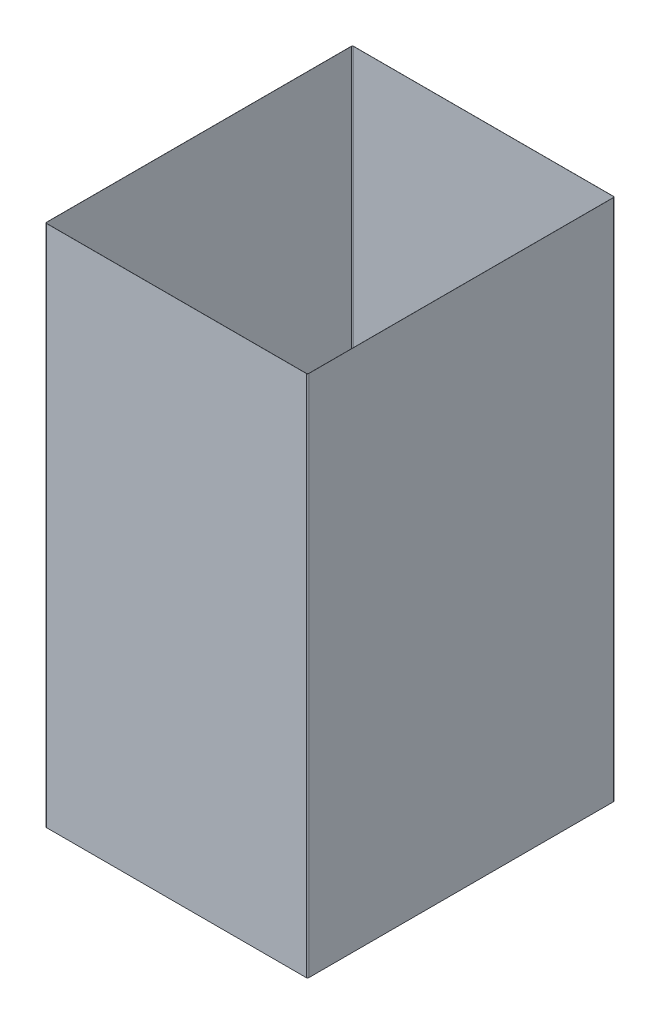
ISO-10303-21;
HEADER;
FILE_DESCRIPTION(('STEP AP214'),'2;1');
FILE_NAME('part.step','',(''),(''),'','','');
FILE_SCHEMA(('AUTOMOTIVE_DESIGN { 1 0 10303 214 1 1 1 1 }'));
ENDSEC;
DATA;
#1=APPLICATION_CONTEXT('core data for automotive mechanical design processes');
#2=APPLICATION_PROTOCOL_DEFINITION('international standard','automotive_design',2000,#1);
#3=PRODUCT_CONTEXT('',#1,'mechanical');
#4=PRODUCT('Part','Part','',(#3));
#5=PRODUCT_RELATED_PRODUCT_CATEGORY('part','',(#4));
#6=PRODUCT_DEFINITION_FORMATION('','',#4);
#7=PRODUCT_DEFINITION_CONTEXT('part definition',#1,'design');
#8=PRODUCT_DEFINITION('design','',#6,#7);
#9=PRODUCT_DEFINITION_SHAPE('','',#8);
#10=(LENGTH_UNIT() NAMED_UNIT(*) SI_UNIT(.MILLI.,.METRE.));
#11=(NAMED_UNIT(*) PLANE_ANGLE_UNIT() SI_UNIT($,.RADIAN.));
#12=(NAMED_UNIT(*) SI_UNIT($,.STERADIAN.) SOLID_ANGLE_UNIT());
#13=UNCERTAINTY_MEASURE_WITH_UNIT(LENGTH_MEASURE(1.E-05),#10,'distance_accuracy_value','');
#14=(GEOMETRIC_REPRESENTATION_CONTEXT(3) GLOBAL_UNCERTAINTY_ASSIGNED_CONTEXT((#13)) GLOBAL_UNIT_ASSIGNED_CONTEXT((#10,
#11,#12)) REPRESENTATION_CONTEXT('',''));
#15=CARTESIAN_POINT('',(0.,0.,0.));
#16=DIRECTION('',(0.,0.,1.));
#17=DIRECTION('',(1.,0.,0.));
#18=AXIS2_PLACEMENT_3D('',#15,#16,#17);
#19=CARTESIAN_POINT('',(241.7,484.8,-283.25));
#20=DIRECTION('',(0.,-1.,0.));
#21=DIRECTION('',(0.,0.,-1.));
#22=AXIS2_PLACEMENT_3D('',#19,#20,#21);
#23=PLANE('',#22);
#24=CARTESIAN_POINT('',(241.7,484.8,-283.25));
#25=DIRECTION('',(0.,-1.,0.));
#26=DIRECTION('',(-1.,0.,0.));
#27=AXIS2_PLACEMENT_3D('',#24,#25,#26);
#28=CIRCLE('',#27,1.1);
#29=CARTESIAN_POINT('',(242.8,484.8,-283.25));
#30=VERTEX_POINT('',#29);
#31=CARTESIAN_POINT('',(241.7,484.8,-284.35));
#32=VERTEX_POINT('',#31);
#33=EDGE_CURVE('E261',#30,#32,#28,.F.);
#34=ORIENTED_EDGE('',*,*,#33,.T.);
#35=DIRECTION('',(-1.,0.,0.));
#36=VECTOR('',#35,1.);
#37=CARTESIAN_POINT('',(241.7,484.8,-284.35));
#38=LINE('',#37,#36);
#39=CARTESIAN_POINT('',(1.00000000000001,484.8,-284.35));
#40=VERTEX_POINT('',#39);
#41=EDGE_CURVE('E264',#32,#40,#38,.T.);
#42=ORIENTED_EDGE('',*,*,#41,.T.);
#43=CARTESIAN_POINT('',(1.,484.8,-283.25));
#44=DIRECTION('',(0.,-1.,0.));
#45=DIRECTION('',(-1.,0.,0.));
#46=AXIS2_PLACEMENT_3D('',#43,#44,#45);
#47=CIRCLE('',#46,1.1);
#48=CARTESIAN_POINT('',(-0.100000000000001,484.8,-283.25));
#49=VERTEX_POINT('',#48);
#50=EDGE_CURVE('E267',#40,#49,#47,.F.);
#51=ORIENTED_EDGE('',*,*,#50,.T.);
#52=DIRECTION('',(0.,0.,1.));
#53=VECTOR('',#52,1.);
#54=CARTESIAN_POINT('',(-0.099999999999989,484.8,-283.25));
#55=LINE('',#54,#53);
#56=CARTESIAN_POINT('',(-0.1,484.8,-1.00000000000001));
#57=VERTEX_POINT('',#56);
#58=EDGE_CURVE('E269',#49,#57,#55,.T.);
#59=ORIENTED_EDGE('',*,*,#58,.T.);
#60=CARTESIAN_POINT('',(1.,484.8,-1.));
#61=DIRECTION('',(0.,-1.,0.));
#62=DIRECTION('',(-1.,0.,0.));
#63=AXIS2_PLACEMENT_3D('',#60,#61,#62);
#64=CIRCLE('',#63,1.1);
#65=CARTESIAN_POINT('',(1.00000000000001,484.8,0.1));
#66=VERTEX_POINT('',#65);
#67=EDGE_CURVE('E271',#57,#66,#64,.F.);
#68=ORIENTED_EDGE('',*,*,#67,.T.);
#69=DIRECTION('',(1.,0.,0.));
#70=VECTOR('',#69,1.);
#71=CARTESIAN_POINT('',(241.7,484.8,0.099999999999989));
#72=LINE('',#71,#70);
#73=CARTESIAN_POINT('',(241.7,484.8,0.1));
#74=VERTEX_POINT('',#73);
#75=EDGE_CURVE('E273',#66,#74,#72,.T.);
#76=ORIENTED_EDGE('',*,*,#75,.T.);
#77=CARTESIAN_POINT('',(241.7,484.8,-1.));
#78=DIRECTION('',(0.,-1.,0.));
#79=DIRECTION('',(-1.,0.,0.));
#80=AXIS2_PLACEMENT_3D('',#77,#78,#79);
#81=CIRCLE('',#80,1.1);
#82=CARTESIAN_POINT('',(242.8,484.8,-1.00000000000001));
#83=VERTEX_POINT('',#82);
#84=EDGE_CURVE('E275',#74,#83,#81,.F.);
#85=ORIENTED_EDGE('',*,*,#84,.T.);
#86=DIRECTION('',(0.,0.,-1.));
#87=VECTOR('',#86,1.);
#88=CARTESIAN_POINT('',(242.8,484.8,-283.25));
#89=LINE('',#88,#87);
#90=EDGE_CURVE('E277',#83,#30,#89,.T.);
#91=ORIENTED_EDGE('',*,*,#90,.T.);
#92=EDGE_LOOP('',(#34,#42,#51,#59,#68,#76,#85,#91));
#93=FACE_BOUND('',#92,.T.);
#94=CARTESIAN_POINT('',(241.7,484.8,-283.25));
#95=DIRECTION('',(0.,1.,0.));
#96=DIRECTION('',(0.,0.,-1.));
#97=AXIS2_PLACEMENT_3D('',#94,#95,#96);
#98=CIRCLE('',#97,1.);
#99=CARTESIAN_POINT('',(242.7,484.8,-283.25));
#100=VERTEX_POINT('',#99);
#101=CARTESIAN_POINT('',(241.7,484.8,-284.25));
#102=VERTEX_POINT('',#101);
#103=EDGE_CURVE('E196',#100,#102,#98,.T.);
#104=ORIENTED_EDGE('',*,*,#103,.F.);
#105=DIRECTION('',(0.,0.,-1.));
#106=VECTOR('',#105,1.);
#107=CARTESIAN_POINT('',(242.7,484.8,-1.00000000000001));
#108=LINE('',#107,#106);
#109=CARTESIAN_POINT('',(242.7,484.8,-1.));
#110=VERTEX_POINT('',#109);
#111=EDGE_CURVE('E229',#110,#100,#108,.T.);
#112=ORIENTED_EDGE('',*,*,#111,.F.);
#113=CARTESIAN_POINT('',(241.7,484.8,-1.));
#114=DIRECTION('',(0.,1.,0.));
#115=DIRECTION('',(0.,0.,1.));
#116=AXIS2_PLACEMENT_3D('',#113,#114,#115);
#117=CIRCLE('',#116,1.);
#118=CARTESIAN_POINT('',(241.7,484.8,0.));
#119=VERTEX_POINT('',#118);
#120=EDGE_CURVE('E227',#119,#110,#117,.T.);
#121=ORIENTED_EDGE('',*,*,#120,.F.);
#122=DIRECTION('',(1.,0.,0.));
#123=VECTOR('',#122,1.);
#124=CARTESIAN_POINT('',(1.00000000000001,484.8,0.));
#125=LINE('',#124,#123);
#126=CARTESIAN_POINT('',(1.00000000000001,484.8,0.));
#127=VERTEX_POINT('',#126);
#128=EDGE_CURVE('E225',#127,#119,#125,.T.);
#129=ORIENTED_EDGE('',*,*,#128,.F.);
#130=CARTESIAN_POINT('',(1.,484.8,-1.));
#131=DIRECTION('',(0.,1.,0.));
#132=DIRECTION('',(0.,0.,-1.));
#133=AXIS2_PLACEMENT_3D('',#130,#131,#132);
#134=CIRCLE('',#133,1.);
#135=CARTESIAN_POINT('',(0.,484.8,-1.00000000000001));
#136=VERTEX_POINT('',#135);
#137=EDGE_CURVE('E223',#136,#127,#134,.T.);
#138=ORIENTED_EDGE('',*,*,#137,.F.);
#139=DIRECTION('',(0.,0.,1.));
#140=VECTOR('',#139,1.);
#141=CARTESIAN_POINT('',(0.,484.8,-1.00000000000001));
#142=LINE('',#141,#140);
#143=CARTESIAN_POINT('',(0.,484.8,-283.25));
#144=VERTEX_POINT('',#143);
#145=EDGE_CURVE('E219',#144,#136,#142,.T.);
#146=ORIENTED_EDGE('',*,*,#145,.F.);
#147=CARTESIAN_POINT('',(1.,484.8,-283.25));
#148=DIRECTION('',(0.,1.,0.));
#149=DIRECTION('',(0.,0.,-1.));
#150=AXIS2_PLACEMENT_3D('',#147,#148,#149);
#151=CIRCLE('',#150,1.);
#152=CARTESIAN_POINT('',(1.00000000000001,484.8,-284.25));
#153=VERTEX_POINT('',#152);
#154=EDGE_CURVE('E217',#153,#144,#151,.T.);
#155=ORIENTED_EDGE('',*,*,#154,.F.);
#156=DIRECTION('',(-1.,0.,0.));
#157=VECTOR('',#156,1.);
#158=CARTESIAN_POINT('',(1.00000000000001,484.8,-284.25));
#159=LINE('',#158,#157);
#160=EDGE_CURVE('E204',#102,#153,#159,.T.);
#161=ORIENTED_EDGE('',*,*,#160,.F.);
#162=EDGE_LOOP('',(#104,#112,#121,#129,#138,#146,#155,#161));
#163=FACE_BOUND('',#162,.T.);
#164=ADVANCED_FACE('F83',(#93,#163),#23,.F.);
#165=CARTESIAN_POINT('',(241.7,0.,-283.25));
#166=DIRECTION('',(0.,-1.,0.));
#167=DIRECTION('',(0.,0.,-1.));
#168=AXIS2_PLACEMENT_3D('',#165,#166,#167);
#169=PLANE('',#168);
#170=CARTESIAN_POINT('',(241.7,0.,-283.25));
#171=DIRECTION('',(0.,-1.,0.));
#172=DIRECTION('',(-1.,0.,0.));
#173=AXIS2_PLACEMENT_3D('',#170,#171,#172);
#174=CIRCLE('',#173,1.1);
#175=CARTESIAN_POINT('',(242.8,0.,-283.25));
#176=VERTEX_POINT('',#175);
#177=CARTESIAN_POINT('',(241.7,0.,-284.35));
#178=VERTEX_POINT('',#177);
#179=EDGE_CURVE('E212',#176,#178,#174,.F.);
#180=ORIENTED_EDGE('',*,*,#179,.F.);
#181=DIRECTION('',(0.,0.,-1.));
#182=VECTOR('',#181,1.);
#183=CARTESIAN_POINT('',(242.8,0.,-283.25));
#184=LINE('',#183,#182);
#185=CARTESIAN_POINT('',(242.8,0.,-1.00000000000001));
#186=VERTEX_POINT('',#185);
#187=EDGE_CURVE('E265',#186,#176,#184,.T.);
#188=ORIENTED_EDGE('',*,*,#187,.F.);
#189=CARTESIAN_POINT('',(241.7,0.,-1.));
#190=DIRECTION('',(0.,-1.,0.));
#191=DIRECTION('',(-1.,0.,0.));
#192=AXIS2_PLACEMENT_3D('',#189,#190,#191);
#193=CIRCLE('',#192,1.1);
#194=CARTESIAN_POINT('',(241.7,0.,0.1));
#195=VERTEX_POINT('',#194);
#196=EDGE_CURVE('E292',#195,#186,#193,.F.);
#197=ORIENTED_EDGE('',*,*,#196,.F.);
#198=DIRECTION('',(1.,0.,0.));
#199=VECTOR('',#198,1.);
#200=CARTESIAN_POINT('',(241.7,0.,0.099999999999989));
#201=LINE('',#200,#199);
#202=CARTESIAN_POINT('',(1.00000000000001,0.,0.1));
#203=VERTEX_POINT('',#202);
#204=EDGE_CURVE('E290',#203,#195,#201,.T.);
#205=ORIENTED_EDGE('',*,*,#204,.F.);
#206=CARTESIAN_POINT('',(1.,0.,-1.));
#207=DIRECTION('',(0.,-1.,0.));
#208=DIRECTION('',(-1.,0.,0.));
#209=AXIS2_PLACEMENT_3D('',#206,#207,#208);
#210=CIRCLE('',#209,1.1);
#211=CARTESIAN_POINT('',(-0.1,0.,-1.00000000000001));
#212=VERTEX_POINT('',#211);
#213=EDGE_CURVE('E288',#212,#203,#210,.F.);
#214=ORIENTED_EDGE('',*,*,#213,.F.);
#215=DIRECTION('',(0.,0.,1.));
#216=VECTOR('',#215,1.);
#217=CARTESIAN_POINT('',(-0.099999999999989,0.,-283.25));
#218=LINE('',#217,#216);
#219=CARTESIAN_POINT('',(-0.100000000000001,0.,-283.25));
#220=VERTEX_POINT('',#219);
#221=EDGE_CURVE('E286',#220,#212,#218,.T.);
#222=ORIENTED_EDGE('',*,*,#221,.F.);
#223=CARTESIAN_POINT('',(1.,0.,-283.25));
#224=DIRECTION('',(0.,-1.,0.));
#225=DIRECTION('',(-1.,0.,0.));
#226=AXIS2_PLACEMENT_3D('',#223,#224,#225);
#227=CIRCLE('',#226,1.1);
#228=CARTESIAN_POINT('',(1.00000000000001,0.,-284.35));
#229=VERTEX_POINT('',#228);
#230=EDGE_CURVE('E284',#229,#220,#227,.F.);
#231=ORIENTED_EDGE('',*,*,#230,.F.);
#232=DIRECTION('',(-1.,0.,0.));
#233=VECTOR('',#232,1.);
#234=CARTESIAN_POINT('',(241.7,0.,-284.35));
#235=LINE('',#234,#233);
#236=EDGE_CURVE('E282',#178,#229,#235,.T.);
#237=ORIENTED_EDGE('',*,*,#236,.F.);
#238=EDGE_LOOP('',(#180,#188,#197,#205,#214,#222,#231,#237));
#239=FACE_BOUND('',#238,.T.);
#240=DIRECTION('',(0.,0.,-1.));
#241=VECTOR('',#240,1.);
#242=CARTESIAN_POINT('',(242.7,0.,-1.00000000000001));
#243=LINE('',#242,#241);
#244=CARTESIAN_POINT('',(242.7,0.,-1.00000000000001));
#245=VERTEX_POINT('',#244);
#246=CARTESIAN_POINT('',(242.7,0.,-283.25));
#247=VERTEX_POINT('',#246);
#248=EDGE_CURVE('E205',#245,#247,#243,.T.);
#249=ORIENTED_EDGE('',*,*,#248,.T.);
#250=CARTESIAN_POINT('',(241.7,0.,-283.25));
#251=DIRECTION('',(0.,1.,0.));
#252=DIRECTION('',(0.,0.,-1.));
#253=AXIS2_PLACEMENT_3D('',#250,#251,#252);
#254=CIRCLE('',#253,1.);
#255=CARTESIAN_POINT('',(241.7,0.,-284.25));
#256=VERTEX_POINT('',#255);
#257=EDGE_CURVE('E106',#247,#256,#254,.T.);
#258=ORIENTED_EDGE('',*,*,#257,.T.);
#259=DIRECTION('',(-1.,0.,0.));
#260=VECTOR('',#259,1.);
#261=CARTESIAN_POINT('',(1.00000000000001,0.,-284.25));
#262=LINE('',#261,#260);
#263=CARTESIAN_POINT('',(1.00000000000001,0.,-284.25));
#264=VERTEX_POINT('',#263);
#265=EDGE_CURVE('E211',#256,#264,#262,.T.);
#266=ORIENTED_EDGE('',*,*,#265,.T.);
#267=CARTESIAN_POINT('',(1.,0.,-283.25));
#268=DIRECTION('',(0.,1.,0.));
#269=DIRECTION('',(0.,0.,-1.));
#270=AXIS2_PLACEMENT_3D('',#267,#268,#269);
#271=CIRCLE('',#270,1.);
#272=CARTESIAN_POINT('',(0.,0.,-283.25));
#273=VERTEX_POINT('',#272);
#274=EDGE_CURVE('E233',#264,#273,#271,.T.);
#275=ORIENTED_EDGE('',*,*,#274,.T.);
#276=DIRECTION('',(0.,0.,1.));
#277=VECTOR('',#276,1.);
#278=CARTESIAN_POINT('',(0.,0.,-1.00000000000001));
#279=LINE('',#278,#277);
#280=CARTESIAN_POINT('',(0.,0.,-1.00000000000001));
#281=VERTEX_POINT('',#280);
#282=EDGE_CURVE('E236',#273,#281,#279,.T.);
#283=ORIENTED_EDGE('',*,*,#282,.T.);
#284=CARTESIAN_POINT('',(1.,0.,-1.));
#285=DIRECTION('',(0.,1.,0.));
#286=DIRECTION('',(0.,0.,-1.));
#287=AXIS2_PLACEMENT_3D('',#284,#285,#286);
#288=CIRCLE('',#287,1.);
#289=CARTESIAN_POINT('',(1.00000000000001,0.,0.));
#290=VERTEX_POINT('',#289);
#291=EDGE_CURVE('E239',#281,#290,#288,.T.);
#292=ORIENTED_EDGE('',*,*,#291,.T.);
#293=DIRECTION('',(1.,0.,0.));
#294=VECTOR('',#293,1.);
#295=CARTESIAN_POINT('',(1.00000000000001,0.,0.));
#296=LINE('',#295,#294);
#297=CARTESIAN_POINT('',(241.7,0.,0.));
#298=VERTEX_POINT('',#297);
#299=EDGE_CURVE('E242',#290,#298,#296,.T.);
#300=ORIENTED_EDGE('',*,*,#299,.T.);
#301=CARTESIAN_POINT('',(241.7,0.,-1.));
#302=DIRECTION('',(0.,1.,0.));
#303=DIRECTION('',(0.,0.,1.));
#304=AXIS2_PLACEMENT_3D('',#301,#302,#303);
#305=CIRCLE('',#304,1.);
#306=EDGE_CURVE('E245',#298,#245,#305,.T.);
#307=ORIENTED_EDGE('',*,*,#306,.T.);
#308=EDGE_LOOP('',(#249,#258,#266,#275,#283,#292,#300,#307));
#309=FACE_BOUND('',#308,.T.);
#310=ADVANCED_FACE('F322',(#239,#309),#169,.T.);
#311=CARTESIAN_POINT('',(241.7,484.8,-283.25));
#312=DIRECTION('',(0.,-1.,0.));
#313=DIRECTION('',(0.,0.,-1.));
#314=AXIS2_PLACEMENT_3D('',#311,#312,#313);
#315=CYLINDRICAL_SURFACE('',#314,1.1);
#316=ORIENTED_EDGE('',*,*,#179,.T.);
#317=DIRECTION('',(0.,-1.,0.));
#318=VECTOR('',#317,1.);
#319=CARTESIAN_POINT('',(241.7,484.8,-284.35));
#320=LINE('',#319,#318);
#321=EDGE_CURVE('E12',#32,#178,#320,.T.);
#322=ORIENTED_EDGE('',*,*,#321,.F.);
#323=ORIENTED_EDGE('',*,*,#33,.F.);
#324=DIRECTION('',(0.,-1.,0.));
#325=VECTOR('',#324,1.);
#326=CARTESIAN_POINT('',(242.8,484.8,-283.25));
#327=LINE('',#326,#325);
#328=EDGE_CURVE('E279',#30,#176,#327,.T.);
#329=ORIENTED_EDGE('',*,*,#328,.T.);
#330=EDGE_LOOP('',(#316,#322,#323,#329));
#331=FACE_BOUND('',#330,.T.);
#332=ADVANCED_FACE('F85',(#331),#315,.T.);
#333=CARTESIAN_POINT('',(241.7,484.8,-284.35));
#334=DIRECTION('',(0.,0.,1.));
#335=DIRECTION('',(1.,0.,0.));
#336=AXIS2_PLACEMENT_3D('',#333,#334,#335);
#337=PLANE('',#336);
#338=ORIENTED_EDGE('',*,*,#236,.T.);
#339=DIRECTION('',(0.,-1.,0.));
#340=VECTOR('',#339,1.);
#341=CARTESIAN_POINT('',(1.00000000000001,484.8,-284.35));
#342=LINE('',#341,#340);
#343=EDGE_CURVE('E91',#40,#229,#342,.T.);
#344=ORIENTED_EDGE('',*,*,#343,.F.);
#345=ORIENTED_EDGE('',*,*,#41,.F.);
#346=ORIENTED_EDGE('',*,*,#321,.T.);
#347=EDGE_LOOP('',(#338,#344,#345,#346));
#348=FACE_BOUND('',#347,.T.);
#349=ADVANCED_FACE('F339',(#348),#337,.F.);
#350=CARTESIAN_POINT('',(1.,484.8,-283.25));
#351=DIRECTION('',(0.,-1.,0.));
#352=DIRECTION('',(0.,0.,-1.));
#353=AXIS2_PLACEMENT_3D('',#350,#351,#352);
#354=CYLINDRICAL_SURFACE('',#353,1.1);
#355=ORIENTED_EDGE('',*,*,#230,.T.);
#356=DIRECTION('',(0.,-1.,0.));
#357=VECTOR('',#356,1.);
#358=CARTESIAN_POINT('',(-0.100000000000001,484.8,-283.25));
#359=LINE('',#358,#357);
#360=EDGE_CURVE('E309',#49,#220,#359,.T.);
#361=ORIENTED_EDGE('',*,*,#360,.F.);
#362=ORIENTED_EDGE('',*,*,#50,.F.);
#363=ORIENTED_EDGE('',*,*,#343,.T.);
#364=EDGE_LOOP('',(#355,#361,#362,#363));
#365=FACE_BOUND('',#364,.T.);
#366=ADVANCED_FACE('F316',(#365),#354,.T.);
#367=CARTESIAN_POINT('',(-0.099999999999989,484.8,-283.25));
#368=DIRECTION('',(1.,0.,0.));
#369=DIRECTION('',(0.,0.,-1.));
#370=AXIS2_PLACEMENT_3D('',#367,#368,#369);
#371=PLANE('',#370);
#372=ORIENTED_EDGE('',*,*,#221,.T.);
#373=DIRECTION('',(0.,-1.,0.));
#374=VECTOR('',#373,1.);
#375=CARTESIAN_POINT('',(-0.1,484.8,-1.00000000000001));
#376=LINE('',#375,#374);
#377=EDGE_CURVE('E306',#57,#212,#376,.T.);
#378=ORIENTED_EDGE('',*,*,#377,.F.);
#379=ORIENTED_EDGE('',*,*,#58,.F.);
#380=ORIENTED_EDGE('',*,*,#360,.T.);
#381=EDGE_LOOP('',(#372,#378,#379,#380));
#382=FACE_BOUND('',#381,.T.);
#383=ADVANCED_FACE('F328',(#382),#371,.F.);
#384=CARTESIAN_POINT('',(1.,484.8,-1.));
#385=DIRECTION('',(0.,-1.,0.));
#386=DIRECTION('',(0.,0.,-1.));
#387=AXIS2_PLACEMENT_3D('',#384,#385,#386);
#388=CYLINDRICAL_SURFACE('',#387,1.1);
#389=ORIENTED_EDGE('',*,*,#213,.T.);
#390=DIRECTION('',(0.,-1.,0.));
#391=VECTOR('',#390,1.);
#392=CARTESIAN_POINT('',(1.00000000000001,484.8,0.1));
#393=LINE('',#392,#391);
#394=EDGE_CURVE('E303',#66,#203,#393,.T.);
#395=ORIENTED_EDGE('',*,*,#394,.F.);
#396=ORIENTED_EDGE('',*,*,#67,.F.);
#397=ORIENTED_EDGE('',*,*,#377,.T.);
#398=EDGE_LOOP('',(#389,#395,#396,#397));
#399=FACE_BOUND('',#398,.T.);
#400=ADVANCED_FACE('F332',(#399),#388,.T.);
#401=CARTESIAN_POINT('',(241.7,484.8,0.099999999999989));
#402=DIRECTION('',(0.,0.,-1.));
#403=DIRECTION('',(-1.,0.,0.));
#404=AXIS2_PLACEMENT_3D('',#401,#402,#403);
#405=PLANE('',#404);
#406=ORIENTED_EDGE('',*,*,#204,.T.);
#407=DIRECTION('',(0.,-1.,0.));
#408=VECTOR('',#407,1.);
#409=CARTESIAN_POINT('',(241.7,484.8,0.1));
#410=LINE('',#409,#408);
#411=EDGE_CURVE('E300',#74,#195,#410,.T.);
#412=ORIENTED_EDGE('',*,*,#411,.F.);
#413=ORIENTED_EDGE('',*,*,#75,.F.);
#414=ORIENTED_EDGE('',*,*,#394,.T.);
#415=EDGE_LOOP('',(#406,#412,#413,#414));
#416=FACE_BOUND('',#415,.T.);
#417=ADVANCED_FACE('F352',(#416),#405,.F.);
#418=CARTESIAN_POINT('',(241.7,484.8,-1.));
#419=DIRECTION('',(0.,-1.,0.));
#420=DIRECTION('',(0.,0.,-1.));
#421=AXIS2_PLACEMENT_3D('',#418,#419,#420);
#422=CYLINDRICAL_SURFACE('',#421,1.1);
#423=ORIENTED_EDGE('',*,*,#196,.T.);
#424=DIRECTION('',(0.,-1.,0.));
#425=VECTOR('',#424,1.);
#426=CARTESIAN_POINT('',(242.8,484.8,-1.00000000000001));
#427=LINE('',#426,#425);
#428=EDGE_CURVE('E297',#83,#186,#427,.T.);
#429=ORIENTED_EDGE('',*,*,#428,.F.);
#430=ORIENTED_EDGE('',*,*,#84,.F.);
#431=ORIENTED_EDGE('',*,*,#411,.T.);
#432=EDGE_LOOP('',(#423,#429,#430,#431));
#433=FACE_BOUND('',#432,.T.);
#434=ADVANCED_FACE('F350',(#433),#422,.T.);
#435=CARTESIAN_POINT('',(242.8,484.8,-283.25));
#436=DIRECTION('',(-1.,0.,0.));
#437=DIRECTION('',(0.,0.,1.));
#438=AXIS2_PLACEMENT_3D('',#435,#436,#437);
#439=PLANE('',#438);
#440=ORIENTED_EDGE('',*,*,#187,.T.);
#441=ORIENTED_EDGE('',*,*,#328,.F.);
#442=ORIENTED_EDGE('',*,*,#90,.F.);
#443=ORIENTED_EDGE('',*,*,#428,.T.);
#444=EDGE_LOOP('',(#440,#441,#442,#443));
#445=FACE_BOUND('',#444,.T.);
#446=ADVANCED_FACE('F345',(#445),#439,.F.);
#447=CARTESIAN_POINT('',(241.7,484.8,-283.25));
#448=DIRECTION('',(0.,-1.,0.));
#449=DIRECTION('',(0.,0.,-1.));
#450=AXIS2_PLACEMENT_3D('',#447,#448,#449);
#451=CYLINDRICAL_SURFACE('',#450,1.);
#452=ORIENTED_EDGE('',*,*,#257,.F.);
#453=DIRECTION('',(0.,-1.,0.));
#454=VECTOR('',#453,1.);
#455=CARTESIAN_POINT('',(242.7,484.8,-283.25));
#456=LINE('',#455,#454);
#457=EDGE_CURVE('E200',#100,#247,#456,.T.);
#458=ORIENTED_EDGE('',*,*,#457,.F.);
#459=ORIENTED_EDGE('',*,*,#103,.T.);
#460=DIRECTION('',(0.,-1.,0.));
#461=VECTOR('',#460,1.);
#462=CARTESIAN_POINT('',(241.7,484.8,-284.25));
#463=LINE('',#462,#461);
#464=EDGE_CURVE('E199',#102,#256,#463,.T.);
#465=ORIENTED_EDGE('',*,*,#464,.T.);
#466=EDGE_LOOP('',(#452,#458,#459,#465));
#467=FACE_BOUND('',#466,.T.);
#468=ADVANCED_FACE('F198',(#467),#451,.F.);
#469=CARTESIAN_POINT('',(1.00000000000001,484.8,-284.25));
#470=DIRECTION('',(0.,0.,1.));
#471=DIRECTION('',(1.,0.,0.));
#472=AXIS2_PLACEMENT_3D('',#469,#470,#471);
#473=PLANE('',#472);
#474=ORIENTED_EDGE('',*,*,#265,.F.);
#475=ORIENTED_EDGE('',*,*,#464,.F.);
#476=ORIENTED_EDGE('',*,*,#160,.T.);
#477=DIRECTION('',(0.,-1.,0.));
#478=VECTOR('',#477,1.);
#479=CARTESIAN_POINT('',(1.00000000000001,484.8,-284.25));
#480=LINE('',#479,#478);
#481=EDGE_CURVE('E213',#153,#264,#480,.T.);
#482=ORIENTED_EDGE('',*,*,#481,.T.);
#483=EDGE_LOOP('',(#474,#475,#476,#482));
#484=FACE_BOUND('',#483,.T.);
#485=ADVANCED_FACE('F208',(#484),#473,.T.);
#486=CARTESIAN_POINT('',(1.,484.8,-283.25));
#487=DIRECTION('',(0.,-1.,0.));
#488=DIRECTION('',(0.,0.,-1.));
#489=AXIS2_PLACEMENT_3D('',#486,#487,#488);
#490=CYLINDRICAL_SURFACE('',#489,1.);
#491=ORIENTED_EDGE('',*,*,#274,.F.);
#492=ORIENTED_EDGE('',*,*,#481,.F.);
#493=ORIENTED_EDGE('',*,*,#154,.T.);
#494=DIRECTION('',(0.,-1.,0.));
#495=VECTOR('',#494,1.);
#496=CARTESIAN_POINT('',(0.,484.8,-283.25));
#497=LINE('',#496,#495);
#498=EDGE_CURVE('E258',#144,#273,#497,.T.);
#499=ORIENTED_EDGE('',*,*,#498,.T.);
#500=EDGE_LOOP('',(#491,#492,#493,#499));
#501=FACE_BOUND('',#500,.T.);
#502=ADVANCED_FACE('F377',(#501),#490,.F.);
#503=CARTESIAN_POINT('',(0.,484.8,-1.00000000000001));
#504=DIRECTION('',(1.,0.,0.));
#505=DIRECTION('',(0.,0.,-1.));
#506=AXIS2_PLACEMENT_3D('',#503,#504,#505);
#507=PLANE('',#506);
#508=ORIENTED_EDGE('',*,*,#282,.F.);
#509=ORIENTED_EDGE('',*,*,#498,.F.);
#510=ORIENTED_EDGE('',*,*,#145,.T.);
#511=DIRECTION('',(0.,-1.,0.));
#512=VECTOR('',#511,1.);
#513=CARTESIAN_POINT('',(0.,484.8,-1.00000000000001));
#514=LINE('',#513,#512);
#515=EDGE_CURVE('E256',#136,#281,#514,.T.);
#516=ORIENTED_EDGE('',*,*,#515,.T.);
#517=EDGE_LOOP('',(#508,#509,#510,#516));
#518=FACE_BOUND('',#517,.T.);
#519=ADVANCED_FACE('F381',(#518),#507,.T.);
#520=CARTESIAN_POINT('',(1.,484.8,-1.));
#521=DIRECTION('',(0.,-1.,0.));
#522=DIRECTION('',(0.,0.,-1.));
#523=AXIS2_PLACEMENT_3D('',#520,#521,#522);
#524=CYLINDRICAL_SURFACE('',#523,1.);
#525=ORIENTED_EDGE('',*,*,#291,.F.);
#526=ORIENTED_EDGE('',*,*,#515,.F.);
#527=ORIENTED_EDGE('',*,*,#137,.T.);
#528=DIRECTION('',(0.,-1.,0.));
#529=VECTOR('',#528,1.);
#530=CARTESIAN_POINT('',(1.00000000000001,484.8,0.));
#531=LINE('',#530,#529);
#532=EDGE_CURVE('E254',#127,#290,#531,.T.);
#533=ORIENTED_EDGE('',*,*,#532,.T.);
#534=EDGE_LOOP('',(#525,#526,#527,#533));
#535=FACE_BOUND('',#534,.T.);
#536=ADVANCED_FACE('F387',(#535),#524,.F.);
#537=CARTESIAN_POINT('',(1.00000000000001,484.8,0.));
#538=DIRECTION('',(0.,0.,-1.));
#539=DIRECTION('',(-1.,0.,0.));
#540=AXIS2_PLACEMENT_3D('',#537,#538,#539);
#541=PLANE('',#540);
#542=ORIENTED_EDGE('',*,*,#299,.F.);
#543=ORIENTED_EDGE('',*,*,#532,.F.);
#544=ORIENTED_EDGE('',*,*,#128,.T.);
#545=DIRECTION('',(0.,-1.,0.));
#546=VECTOR('',#545,1.);
#547=CARTESIAN_POINT('',(241.7,484.8,0.));
#548=LINE('',#547,#546);
#549=EDGE_CURVE('E252',#119,#298,#548,.T.);
#550=ORIENTED_EDGE('',*,*,#549,.T.);
#551=EDGE_LOOP('',(#542,#543,#544,#550));
#552=FACE_BOUND('',#551,.T.);
#553=ADVANCED_FACE('F391',(#552),#541,.T.);
#554=CARTESIAN_POINT('',(241.7,484.8,-1.));
#555=DIRECTION('',(0.,-1.,0.));
#556=DIRECTION('',(0.,0.,-1.));
#557=AXIS2_PLACEMENT_3D('',#554,#555,#556);
#558=CYLINDRICAL_SURFACE('',#557,1.);
#559=ORIENTED_EDGE('',*,*,#306,.F.);
#560=ORIENTED_EDGE('',*,*,#549,.F.);
#561=ORIENTED_EDGE('',*,*,#120,.T.);
#562=DIRECTION('',(0.,-1.,0.));
#563=VECTOR('',#562,1.);
#564=CARTESIAN_POINT('',(242.7,484.8,-1.00000000000001));
#565=LINE('',#564,#563);
#566=EDGE_CURVE('E98',#110,#245,#565,.T.);
#567=ORIENTED_EDGE('',*,*,#566,.T.);
#568=EDGE_LOOP('',(#559,#560,#561,#567));
#569=FACE_BOUND('',#568,.T.);
#570=ADVANCED_FACE('F395',(#569),#558,.F.);
#571=CARTESIAN_POINT('',(242.7,484.8,-1.00000000000001));
#572=DIRECTION('',(-1.,0.,0.));
#573=DIRECTION('',(0.,0.,1.));
#574=AXIS2_PLACEMENT_3D('',#571,#572,#573);
#575=PLANE('',#574);
#576=ORIENTED_EDGE('',*,*,#248,.F.);
#577=ORIENTED_EDGE('',*,*,#566,.F.);
#578=ORIENTED_EDGE('',*,*,#111,.T.);
#579=ORIENTED_EDGE('',*,*,#457,.T.);
#580=EDGE_LOOP('',(#576,#577,#578,#579));
#581=FACE_BOUND('',#580,.T.);
#582=ADVANCED_FACE('F399',(#581),#575,.T.);
#583=CLOSED_SHELL('',(#164,#310,#332,#349,#366,#383,#400,#417,#434,#446,#468,#485,#502,#519,
#536,#553,#570,#582));
#584=MANIFOLD_SOLID_BREP('B2',#583);
#585=ADVANCED_BREP_SHAPE_REPRESENTATION('',(#18,#584),#14);
#586=SHAPE_DEFINITION_REPRESENTATION(#9,#585);
ENDSEC;
END-ISO-10303-21;
